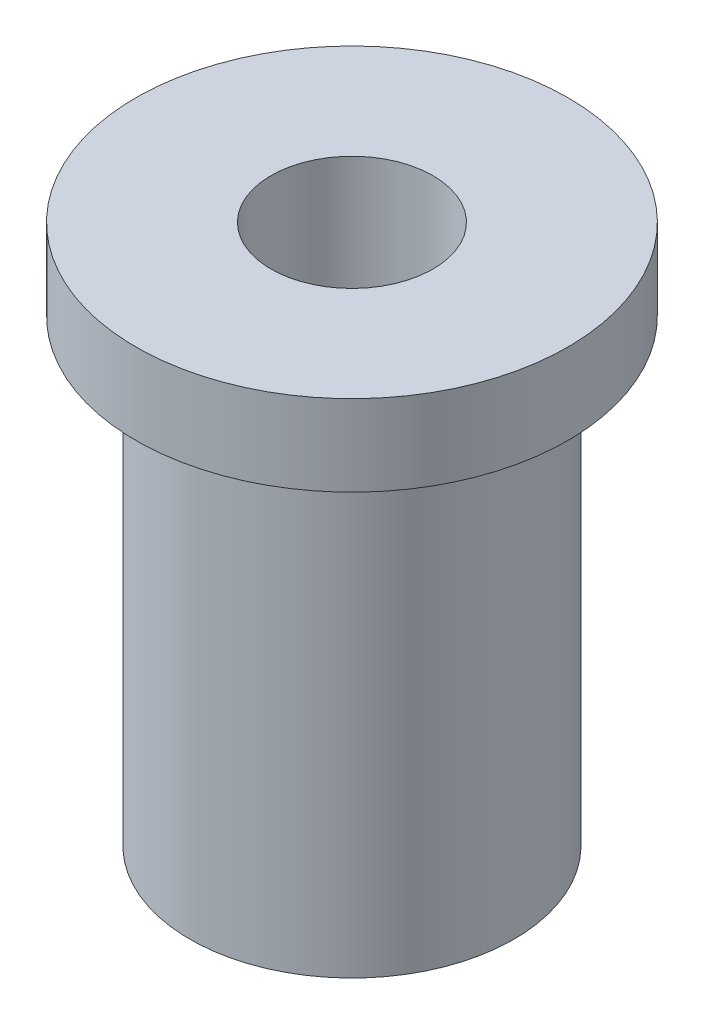
ISO-10303-21;
HEADER;
FILE_DESCRIPTION(('STEP AP214'),'2;1');
FILE_NAME('part.step','',(''),(''),'','','');
FILE_SCHEMA(('AUTOMOTIVE_DESIGN { 1 0 10303 214 1 1 1 1 }'));
ENDSEC;
DATA;
#1=APPLICATION_CONTEXT('core data for automotive mechanical design processes');
#2=APPLICATION_PROTOCOL_DEFINITION('international standard','automotive_design',2000,#1);
#3=PRODUCT_CONTEXT('',#1,'mechanical');
#4=PRODUCT('Part','Part','',(#3));
#5=PRODUCT_RELATED_PRODUCT_CATEGORY('part','',(#4));
#6=PRODUCT_DEFINITION_FORMATION('','',#4);
#7=PRODUCT_DEFINITION_CONTEXT('part definition',#1,'design');
#8=PRODUCT_DEFINITION('design','',#6,#7);
#9=PRODUCT_DEFINITION_SHAPE('','',#8);
#10=(LENGTH_UNIT() NAMED_UNIT(*) SI_UNIT(.MILLI.,.METRE.));
#11=(NAMED_UNIT(*) PLANE_ANGLE_UNIT() SI_UNIT($,.RADIAN.));
#12=(NAMED_UNIT(*) SI_UNIT($,.STERADIAN.) SOLID_ANGLE_UNIT());
#13=UNCERTAINTY_MEASURE_WITH_UNIT(LENGTH_MEASURE(1.E-05),#10,'distance_accuracy_value','');
#14=(GEOMETRIC_REPRESENTATION_CONTEXT(3) GLOBAL_UNCERTAINTY_ASSIGNED_CONTEXT((#13)) GLOBAL_UNIT_ASSIGNED_CONTEXT((#10,
#11,#12)) REPRESENTATION_CONTEXT('',''));
#15=CARTESIAN_POINT('',(0.,0.,0.));
#16=DIRECTION('',(0.,0.,1.));
#17=DIRECTION('',(1.,0.,0.));
#18=AXIS2_PLACEMENT_3D('',#15,#16,#17);
#19=CARTESIAN_POINT('',(6.,0.,0.));
#20=DIRECTION('',(0.,-1.,0.));
#21=DIRECTION('',(0.,0.,-1.));
#22=AXIS2_PLACEMENT_3D('',#19,#20,#21);
#23=PLANE('',#22);
#24=CARTESIAN_POINT('',(0.,0.,0.));
#25=DIRECTION('',(0.,-1.,0.));
#26=DIRECTION('',(0.,0.,-1.));
#27=AXIS2_PLACEMENT_3D('',#24,#25,#26);
#28=CIRCLE('',#27,6.);
#29=CARTESIAN_POINT('',(0.,0.,-6.));
#30=VERTEX_POINT('',#29);
#31=EDGE_CURVE('E10',#30,#30,#28,.T.);
#32=ORIENTED_EDGE('',*,*,#31,.T.);
#33=EDGE_LOOP('',(#32));
#34=FACE_BOUND('',#33,.T.);
#35=CARTESIAN_POINT('',(0.,0.,0.));
#36=DIRECTION('',(0.,-1.,0.));
#37=DIRECTION('',(0.,0.,-1.));
#38=AXIS2_PLACEMENT_3D('',#35,#36,#37);
#39=CIRCLE('',#38,3.);
#40=CARTESIAN_POINT('',(0.,0.,-3.));
#41=VERTEX_POINT('',#40);
#42=EDGE_CURVE('E51',#41,#41,#39,.T.);
#43=ORIENTED_EDGE('',*,*,#42,.F.);
#44=EDGE_LOOP('',(#43));
#45=FACE_BOUND('',#44,.T.);
#46=ADVANCED_FACE('F29',(#34,#45),#23,.T.);
#47=CARTESIAN_POINT('',(0.,0.,0.));
#48=DIRECTION('',(0.,-1.,0.));
#49=DIRECTION('',(0.,0.,-1.));
#50=AXIS2_PLACEMENT_3D('',#47,#48,#49);
#51=CYLINDRICAL_SURFACE('',#50,6.);
#52=CARTESIAN_POINT('',(0.,17.,0.));
#53=DIRECTION('',(0.,-1.,0.));
#54=DIRECTION('',(0.,0.,-1.));
#55=AXIS2_PLACEMENT_3D('',#52,#53,#54);
#56=CIRCLE('',#55,6.);
#57=CARTESIAN_POINT('',(0.,17.,-6.));
#58=VERTEX_POINT('',#57);
#59=EDGE_CURVE('E35',#58,#58,#56,.T.);
#60=ORIENTED_EDGE('',*,*,#59,.T.);
#61=EDGE_LOOP('',(#60));
#62=FACE_BOUND('',#61,.T.);
#63=ORIENTED_EDGE('',*,*,#31,.F.);
#64=EDGE_LOOP('',(#63));
#65=FACE_BOUND('',#64,.T.);
#66=ADVANCED_FACE('F59',(#62,#65),#51,.T.);
#67=CARTESIAN_POINT('',(8.,17.,0.));
#68=DIRECTION('',(0.,-1.,0.));
#69=DIRECTION('',(0.,0.,-1.));
#70=AXIS2_PLACEMENT_3D('',#67,#68,#69);
#71=PLANE('',#70);
#72=CARTESIAN_POINT('',(0.,17.,0.));
#73=DIRECTION('',(0.,-1.,0.));
#74=DIRECTION('',(0.,0.,-1.));
#75=AXIS2_PLACEMENT_3D('',#72,#73,#74);
#76=CIRCLE('',#75,8.);
#77=CARTESIAN_POINT('',(0.,17.,-8.));
#78=VERTEX_POINT('',#77);
#79=EDGE_CURVE('E39',#78,#78,#76,.T.);
#80=ORIENTED_EDGE('',*,*,#79,.T.);
#81=EDGE_LOOP('',(#80));
#82=FACE_BOUND('',#81,.T.);
#83=ORIENTED_EDGE('',*,*,#59,.F.);
#84=EDGE_LOOP('',(#83));
#85=FACE_BOUND('',#84,.T.);
#86=ADVANCED_FACE('F63',(#82,#85),#71,.T.);
#87=CARTESIAN_POINT('',(0.,0.,0.));
#88=DIRECTION('',(0.,-1.,0.));
#89=DIRECTION('',(0.,0.,-1.));
#90=AXIS2_PLACEMENT_3D('',#87,#88,#89);
#91=CYLINDRICAL_SURFACE('',#90,8.);
#92=CARTESIAN_POINT('',(0.,20.,0.));
#93=DIRECTION('',(0.,-1.,0.));
#94=DIRECTION('',(0.,0.,-1.));
#95=AXIS2_PLACEMENT_3D('',#92,#93,#94);
#96=CIRCLE('',#95,8.);
#97=CARTESIAN_POINT('',(0.,20.,-8.));
#98=VERTEX_POINT('',#97);
#99=EDGE_CURVE('E43',#98,#98,#96,.T.);
#100=ORIENTED_EDGE('',*,*,#99,.T.);
#101=EDGE_LOOP('',(#100));
#102=FACE_BOUND('',#101,.T.);
#103=ORIENTED_EDGE('',*,*,#79,.F.);
#104=EDGE_LOOP('',(#103));
#105=FACE_BOUND('',#104,.T.);
#106=ADVANCED_FACE('F67',(#102,#105),#91,.T.);
#107=CARTESIAN_POINT('',(3.,20.,0.));
#108=DIRECTION('',(0.,1.,0.));
#109=DIRECTION('',(0.,0.,1.));
#110=AXIS2_PLACEMENT_3D('',#107,#108,#109);
#111=PLANE('',#110);
#112=CARTESIAN_POINT('',(0.,20.,0.));
#113=DIRECTION('',(0.,-1.,0.));
#114=DIRECTION('',(0.,0.,-1.));
#115=AXIS2_PLACEMENT_3D('',#112,#113,#114);
#116=CIRCLE('',#115,3.);
#117=CARTESIAN_POINT('',(0.,20.,-3.));
#118=VERTEX_POINT('',#117);
#119=EDGE_CURVE('E48',#118,#118,#116,.T.);
#120=ORIENTED_EDGE('',*,*,#119,.T.);
#121=EDGE_LOOP('',(#120));
#122=FACE_BOUND('',#121,.T.);
#123=ORIENTED_EDGE('',*,*,#99,.F.);
#124=EDGE_LOOP('',(#123));
#125=FACE_BOUND('',#124,.T.);
#126=ADVANCED_FACE('F74',(#122,#125),#111,.T.);
#127=CARTESIAN_POINT('',(0.,0.,0.));
#128=DIRECTION('',(0.,-1.,0.));
#129=DIRECTION('',(0.,0.,-1.));
#130=AXIS2_PLACEMENT_3D('',#127,#128,#129);
#131=CYLINDRICAL_SURFACE('',#130,3.);
#132=ORIENTED_EDGE('',*,*,#42,.T.);
#133=EDGE_LOOP('',(#132));
#134=FACE_BOUND('',#133,.T.);
#135=ORIENTED_EDGE('',*,*,#119,.F.);
#136=EDGE_LOOP('',(#135));
#137=FACE_BOUND('',#136,.T.);
#138=ADVANCED_FACE('F55',(#134,#137),#131,.F.);
#139=CLOSED_SHELL('',(#46,#66,#86,#106,#126,#138));
#140=MANIFOLD_SOLID_BREP('B2',#139);
#141=ADVANCED_BREP_SHAPE_REPRESENTATION('',(#18,#140),#14);
#142=SHAPE_DEFINITION_REPRESENTATION(#9,#141);
ENDSEC;
END-ISO-10303-21;
